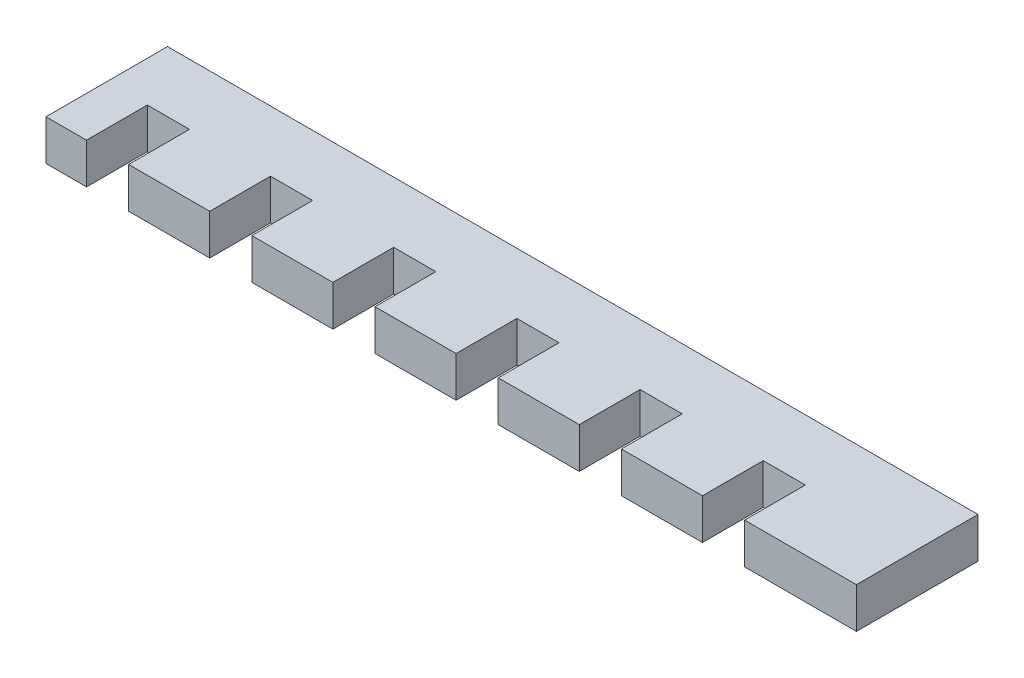
ISO-10303-21;
HEADER;
FILE_DESCRIPTION(('STEP AP214'),'2;1');
FILE_NAME('part.step','',(''),(''),'','','');
FILE_SCHEMA(('AUTOMOTIVE_DESIGN { 1 0 10303 214 1 1 1 1 }'));
ENDSEC;
DATA;
#1=APPLICATION_CONTEXT('core data for automotive mechanical design processes');
#2=APPLICATION_PROTOCOL_DEFINITION('international standard','automotive_design',2000,#1);
#3=PRODUCT_CONTEXT('',#1,'mechanical');
#4=PRODUCT('Part','Part','',(#3));
#5=PRODUCT_RELATED_PRODUCT_CATEGORY('part','',(#4));
#6=PRODUCT_DEFINITION_FORMATION('','',#4);
#7=PRODUCT_DEFINITION_CONTEXT('part definition',#1,'design');
#8=PRODUCT_DEFINITION('design','',#6,#7);
#9=PRODUCT_DEFINITION_SHAPE('','',#8);
#10=(LENGTH_UNIT() NAMED_UNIT(*) SI_UNIT(.MILLI.,.METRE.));
#11=(NAMED_UNIT(*) PLANE_ANGLE_UNIT() SI_UNIT($,.RADIAN.));
#12=(NAMED_UNIT(*) SI_UNIT($,.STERADIAN.) SOLID_ANGLE_UNIT());
#13=UNCERTAINTY_MEASURE_WITH_UNIT(LENGTH_MEASURE(1.E-05),#10,'distance_accuracy_value','');
#14=(GEOMETRIC_REPRESENTATION_CONTEXT(3) GLOBAL_UNCERTAINTY_ASSIGNED_CONTEXT((#13)) GLOBAL_UNIT_ASSIGNED_CONTEXT((#10,
#11,#12)) REPRESENTATION_CONTEXT('',''));
#15=CARTESIAN_POINT('',(0.,0.,0.));
#16=DIRECTION('',(0.,0.,1.));
#17=DIRECTION('',(1.,0.,0.));
#18=AXIS2_PLACEMENT_3D('',#15,#16,#17);
#19=CARTESIAN_POINT('',(-50.,5.,7.5));
#20=DIRECTION('',(0.,0.,-1.));
#21=DIRECTION('',(-1.,0.,0.));
#22=AXIS2_PLACEMENT_3D('',#19,#20,#21);
#23=PLANE('',#22);
#24=DIRECTION('',(0.,-1.,0.));
#25=VECTOR('',#24,1.);
#26=CARTESIAN_POINT('',(-29.8,5.,7.5));
#27=LINE('',#26,#25);
#28=CARTESIAN_POINT('',(-29.8,5.,7.5));
#29=VERTEX_POINT('',#28);
#30=CARTESIAN_POINT('',(-29.8,0.,7.5));
#31=VERTEX_POINT('',#30);
#32=EDGE_CURVE('E221',#29,#31,#27,.T.);
#33=ORIENTED_EDGE('',*,*,#32,.F.);
#34=DIRECTION('',(1.,0.,0.));
#35=VECTOR('',#34,1.);
#36=CARTESIAN_POINT('',(-50.,5.,7.5));
#37=LINE('',#36,#35);
#38=CARTESIAN_POINT('',(-39.8,5.,7.5));
#39=VERTEX_POINT('',#38);
#40=EDGE_CURVE('E233',#39,#29,#37,.T.);
#41=ORIENTED_EDGE('',*,*,#40,.F.);
#42=DIRECTION('',(0.,-1.,0.));
#43=VECTOR('',#42,1.);
#44=CARTESIAN_POINT('',(-39.8,5.,7.5));
#45=LINE('',#44,#43);
#46=CARTESIAN_POINT('',(-39.8,0.,7.5));
#47=VERTEX_POINT('',#46);
#48=EDGE_CURVE('E298',#39,#47,#45,.T.);
#49=ORIENTED_EDGE('',*,*,#48,.T.);
#50=DIRECTION('',(1.,0.,0.));
#51=VECTOR('',#50,1.);
#52=CARTESIAN_POINT('',(-50.,0.,7.5));
#53=LINE('',#52,#51);
#54=EDGE_CURVE('E235',#47,#31,#53,.T.);
#55=ORIENTED_EDGE('',*,*,#54,.T.);
#56=EDGE_LOOP('',(#33,#41,#49,#55));
#57=FACE_BOUND('',#56,.T.);
#58=ADVANCED_FACE('F33',(#57),#23,.F.);
#59=DIRECTION('',(0.,-1.,0.));
#60=VECTOR('',#59,1.);
#61=CARTESIAN_POINT('',(-24.6,5.,7.5));
#62=LINE('',#61,#60);
#63=CARTESIAN_POINT('',(-24.6,5.,7.5));
#64=VERTEX_POINT('',#63);
#65=CARTESIAN_POINT('',(-24.6,0.,7.5));
#66=VERTEX_POINT('',#65);
#67=EDGE_CURVE('E237',#64,#66,#62,.T.);
#68=ORIENTED_EDGE('',*,*,#67,.T.);
#69=CARTESIAN_POINT('',(-14.6,0.,7.5));
#70=VERTEX_POINT('',#69);
#71=EDGE_CURVE('E435',#66,#70,#53,.T.);
#72=ORIENTED_EDGE('',*,*,#71,.T.);
#73=DIRECTION('',(0.,-1.,0.));
#74=VECTOR('',#73,1.);
#75=CARTESIAN_POINT('',(-14.6,5.,7.5));
#76=LINE('',#75,#74);
#77=CARTESIAN_POINT('',(-14.6,5.,7.5));
#78=VERTEX_POINT('',#77);
#79=EDGE_CURVE('E390',#78,#70,#76,.T.);
#80=ORIENTED_EDGE('',*,*,#79,.F.);
#81=EDGE_CURVE('E244',#64,#78,#37,.T.);
#82=ORIENTED_EDGE('',*,*,#81,.F.);
#83=EDGE_LOOP('',(#68,#72,#80,#82));
#84=FACE_BOUND('',#83,.T.);
#85=ADVANCED_FACE('F437',(#84),#23,.F.);
#86=DIRECTION('',(0.,-1.,0.));
#87=VECTOR('',#86,1.);
#88=CARTESIAN_POINT('',(-9.4,5.,7.5));
#89=LINE('',#88,#87);
#90=CARTESIAN_POINT('',(-9.4,5.,7.5));
#91=VERTEX_POINT('',#90);
#92=CARTESIAN_POINT('',(-9.4,0.,7.5));
#93=VERTEX_POINT('',#92);
#94=EDGE_CURVE('E392',#91,#93,#89,.T.);
#95=ORIENTED_EDGE('',*,*,#94,.T.);
#96=CARTESIAN_POINT('',(0.599999999999996,0.,7.5));
#97=VERTEX_POINT('',#96);
#98=EDGE_CURVE('E449',#93,#97,#53,.T.);
#99=ORIENTED_EDGE('',*,*,#98,.T.);
#100=DIRECTION('',(0.,-1.,0.));
#101=VECTOR('',#100,1.);
#102=CARTESIAN_POINT('',(0.599999999999996,5.,7.5));
#103=LINE('',#102,#101);
#104=CARTESIAN_POINT('',(0.599999999999996,5.,7.5));
#105=VERTEX_POINT('',#104);
#106=EDGE_CURVE('E366',#105,#97,#103,.T.);
#107=ORIENTED_EDGE('',*,*,#106,.F.);
#108=EDGE_CURVE('E250',#91,#105,#37,.T.);
#109=ORIENTED_EDGE('',*,*,#108,.F.);
#110=EDGE_LOOP('',(#95,#99,#107,#109));
#111=FACE_BOUND('',#110,.T.);
#112=ADVANCED_FACE('F454',(#111),#23,.F.);
#113=DIRECTION('',(0.,-1.,0.));
#114=VECTOR('',#113,1.);
#115=CARTESIAN_POINT('',(5.8,5.,7.5));
#116=LINE('',#115,#114);
#117=CARTESIAN_POINT('',(5.8,5.,7.5));
#118=VERTEX_POINT('',#117);
#119=CARTESIAN_POINT('',(5.8,0.,7.5));
#120=VERTEX_POINT('',#119);
#121=EDGE_CURVE('E368',#118,#120,#116,.T.);
#122=ORIENTED_EDGE('',*,*,#121,.T.);
#123=CARTESIAN_POINT('',(15.8,0.,7.5));
#124=VERTEX_POINT('',#123);
#125=EDGE_CURVE('E527',#120,#124,#53,.T.);
#126=ORIENTED_EDGE('',*,*,#125,.T.);
#127=DIRECTION('',(0.,-1.,0.));
#128=VECTOR('',#127,1.);
#129=CARTESIAN_POINT('',(15.8,5.,7.5));
#130=LINE('',#129,#128);
#131=CARTESIAN_POINT('',(15.8,5.,7.5));
#132=VERTEX_POINT('',#131);
#133=EDGE_CURVE('E341',#132,#124,#130,.T.);
#134=ORIENTED_EDGE('',*,*,#133,.F.);
#135=EDGE_CURVE('E458',#118,#132,#37,.T.);
#136=ORIENTED_EDGE('',*,*,#135,.F.);
#137=EDGE_LOOP('',(#122,#126,#134,#136));
#138=FACE_BOUND('',#137,.T.);
#139=ADVANCED_FACE('F516',(#138),#23,.F.);
#140=DIRECTION('',(0.,-1.,0.));
#141=VECTOR('',#140,1.);
#142=CARTESIAN_POINT('',(21.,5.,7.5));
#143=LINE('',#142,#141);
#144=CARTESIAN_POINT('',(21.,5.,7.5));
#145=VERTEX_POINT('',#144);
#146=CARTESIAN_POINT('',(21.,0.,7.5));
#147=VERTEX_POINT('',#146);
#148=EDGE_CURVE('E344',#145,#147,#143,.T.);
#149=ORIENTED_EDGE('',*,*,#148,.T.);
#150=CARTESIAN_POINT('',(31.,0.,7.5));
#151=VERTEX_POINT('',#150);
#152=EDGE_CURVE('E474',#147,#151,#53,.T.);
#153=ORIENTED_EDGE('',*,*,#152,.T.);
#154=DIRECTION('',(0.,-1.,0.));
#155=VECTOR('',#154,1.);
#156=CARTESIAN_POINT('',(31.,5.,7.5));
#157=LINE('',#156,#155);
#158=CARTESIAN_POINT('',(31.,5.,7.5));
#159=VERTEX_POINT('',#158);
#160=EDGE_CURVE('E315',#159,#151,#157,.T.);
#161=ORIENTED_EDGE('',*,*,#160,.F.);
#162=EDGE_CURVE('E294',#145,#159,#37,.T.);
#163=ORIENTED_EDGE('',*,*,#162,.F.);
#164=EDGE_LOOP('',(#149,#153,#161,#163));
#165=FACE_BOUND('',#164,.T.);
#166=ADVANCED_FACE('F471',(#165),#23,.F.);
#167=DIRECTION('',(0.,-1.,0.));
#168=VECTOR('',#167,1.);
#169=CARTESIAN_POINT('',(36.2,5.,7.5));
#170=LINE('',#169,#168);
#171=CARTESIAN_POINT('',(36.2,5.,7.5));
#172=VERTEX_POINT('',#171);
#173=CARTESIAN_POINT('',(36.2,0.,7.5));
#174=VERTEX_POINT('',#173);
#175=EDGE_CURVE('E318',#172,#174,#170,.T.);
#176=ORIENTED_EDGE('',*,*,#175,.T.);
#177=CARTESIAN_POINT('',(50.,0.,7.5));
#178=VERTEX_POINT('',#177);
#179=EDGE_CURVE('E263',#174,#178,#53,.T.);
#180=ORIENTED_EDGE('',*,*,#179,.T.);
#181=DIRECTION('',(0.,-1.,0.));
#182=VECTOR('',#181,1.);
#183=CARTESIAN_POINT('',(50.,5.,7.5));
#184=LINE('',#183,#182);
#185=CARTESIAN_POINT('',(50.,5.,7.5));
#186=VERTEX_POINT('',#185);
#187=EDGE_CURVE('E247',#186,#178,#184,.T.);
#188=ORIENTED_EDGE('',*,*,#187,.F.);
#189=EDGE_CURVE('E248',#172,#186,#37,.T.);
#190=ORIENTED_EDGE('',*,*,#189,.F.);
#191=EDGE_LOOP('',(#176,#180,#188,#190));
#192=FACE_BOUND('',#191,.T.);
#193=ADVANCED_FACE('F488',(#192),#23,.F.);
#194=CARTESIAN_POINT('',(0.,5.,0.));
#195=DIRECTION('',(0.,1.,0.));
#196=DIRECTION('',(0.,0.,1.));
#197=AXIS2_PLACEMENT_3D('',#194,#195,#196);
#198=PLANE('',#197);
#199=ORIENTED_EDGE('',*,*,#40,.T.);
#200=DIRECTION('',(0.,0.,1.));
#201=VECTOR('',#200,1.);
#202=CARTESIAN_POINT('',(-29.8,5.,7.5));
#203=LINE('',#202,#201);
#204=CARTESIAN_POINT('',(-29.8,5.,0.));
#205=VERTEX_POINT('',#204);
#206=EDGE_CURVE('E218',#205,#29,#203,.T.);
#207=ORIENTED_EDGE('',*,*,#206,.F.);
#208=DIRECTION('',(-1.,0.,0.));
#209=VECTOR('',#208,1.);
#210=CARTESIAN_POINT('',(-29.8,5.,0.));
#211=LINE('',#210,#209);
#212=CARTESIAN_POINT('',(-24.6,5.,0.));
#213=VERTEX_POINT('',#212);
#214=EDGE_CURVE('E417',#213,#205,#211,.T.);
#215=ORIENTED_EDGE('',*,*,#214,.F.);
#216=DIRECTION('',(0.,0.,-1.));
#217=VECTOR('',#216,1.);
#218=CARTESIAN_POINT('',(-24.6,5.,7.5));
#219=LINE('',#218,#217);
#220=EDGE_CURVE('E226',#64,#213,#219,.T.);
#221=ORIENTED_EDGE('',*,*,#220,.F.);
#222=ORIENTED_EDGE('',*,*,#81,.T.);
#223=DIRECTION('',(0.,0.,1.));
#224=VECTOR('',#223,1.);
#225=CARTESIAN_POINT('',(-14.6,5.,7.5));
#226=LINE('',#225,#224);
#227=CARTESIAN_POINT('',(-14.6,5.,0.));
#228=VERTEX_POINT('',#227);
#229=EDGE_CURVE('E403',#228,#78,#226,.T.);
#230=ORIENTED_EDGE('',*,*,#229,.F.);
#231=DIRECTION('',(-1.,0.,0.));
#232=VECTOR('',#231,1.);
#233=CARTESIAN_POINT('',(-14.6,5.,0.));
#234=LINE('',#233,#232);
#235=CARTESIAN_POINT('',(-9.4,5.,0.));
#236=VERTEX_POINT('',#235);
#237=EDGE_CURVE('E399',#236,#228,#234,.T.);
#238=ORIENTED_EDGE('',*,*,#237,.F.);
#239=DIRECTION('',(0.,0.,-1.));
#240=VECTOR('',#239,1.);
#241=CARTESIAN_POINT('',(-9.4,5.,7.5));
#242=LINE('',#241,#240);
#243=EDGE_CURVE('E409',#91,#236,#242,.T.);
#244=ORIENTED_EDGE('',*,*,#243,.F.);
#245=ORIENTED_EDGE('',*,*,#108,.T.);
#246=DIRECTION('',(0.,0.,1.));
#247=VECTOR('',#246,1.);
#248=CARTESIAN_POINT('',(0.599999999999996,5.,7.5));
#249=LINE('',#248,#247);
#250=CARTESIAN_POINT('',(0.599999999999998,5.,0.));
#251=VERTEX_POINT('',#250);
#252=EDGE_CURVE('E380',#251,#105,#249,.T.);
#253=ORIENTED_EDGE('',*,*,#252,.F.);
#254=DIRECTION('',(-1.,0.,0.));
#255=VECTOR('',#254,1.);
#256=CARTESIAN_POINT('',(0.599999999999998,5.,0.));
#257=LINE('',#256,#255);
#258=CARTESIAN_POINT('',(5.8,5.,0.));
#259=VERTEX_POINT('',#258);
#260=EDGE_CURVE('E376',#259,#251,#257,.T.);
#261=ORIENTED_EDGE('',*,*,#260,.F.);
#262=DIRECTION('',(0.,0.,-1.));
#263=VECTOR('',#262,1.);
#264=CARTESIAN_POINT('',(5.8,5.,7.5));
#265=LINE('',#264,#263);
#266=EDGE_CURVE('E387',#118,#259,#265,.T.);
#267=ORIENTED_EDGE('',*,*,#266,.F.);
#268=ORIENTED_EDGE('',*,*,#135,.T.);
#269=DIRECTION('',(0.,0.,1.));
#270=VECTOR('',#269,1.);
#271=CARTESIAN_POINT('',(15.8,5.,7.5));
#272=LINE('',#271,#270);
#273=CARTESIAN_POINT('',(15.8,5.,0.));
#274=VERTEX_POINT('',#273);
#275=EDGE_CURVE('E356',#274,#132,#272,.T.);
#276=ORIENTED_EDGE('',*,*,#275,.F.);
#277=DIRECTION('',(-1.,0.,0.));
#278=VECTOR('',#277,1.);
#279=CARTESIAN_POINT('',(15.8,5.,0.));
#280=LINE('',#279,#278);
#281=CARTESIAN_POINT('',(21.,5.,0.));
#282=VERTEX_POINT('',#281);
#283=EDGE_CURVE('E352',#282,#274,#280,.T.);
#284=ORIENTED_EDGE('',*,*,#283,.F.);
#285=DIRECTION('',(0.,0.,-1.));
#286=VECTOR('',#285,1.);
#287=CARTESIAN_POINT('',(21.,5.,7.5));
#288=LINE('',#287,#286);
#289=EDGE_CURVE('E363',#145,#282,#288,.T.);
#290=ORIENTED_EDGE('',*,*,#289,.F.);
#291=ORIENTED_EDGE('',*,*,#162,.T.);
#292=DIRECTION('',(0.,0.,1.));
#293=VECTOR('',#292,1.);
#294=CARTESIAN_POINT('',(31.,5.,7.5));
#295=LINE('',#294,#293);
#296=CARTESIAN_POINT('',(31.,5.,0.));
#297=VERTEX_POINT('',#296);
#298=EDGE_CURVE('E330',#297,#159,#295,.T.);
#299=ORIENTED_EDGE('',*,*,#298,.F.);
#300=DIRECTION('',(-1.,0.,0.));
#301=VECTOR('',#300,1.);
#302=CARTESIAN_POINT('',(31.,5.,0.));
#303=LINE('',#302,#301);
#304=CARTESIAN_POINT('',(36.2,5.,0.));
#305=VERTEX_POINT('',#304);
#306=EDGE_CURVE('E326',#305,#297,#303,.T.);
#307=ORIENTED_EDGE('',*,*,#306,.F.);
#308=DIRECTION('',(0.,0.,-1.));
#309=VECTOR('',#308,1.);
#310=CARTESIAN_POINT('',(36.2,5.,7.5));
#311=LINE('',#310,#309);
#312=EDGE_CURVE('E338',#172,#305,#311,.T.);
#313=ORIENTED_EDGE('',*,*,#312,.F.);
#314=ORIENTED_EDGE('',*,*,#189,.T.);
#315=DIRECTION('',(0.,0.,-1.));
#316=VECTOR('',#315,1.);
#317=CARTESIAN_POINT('',(50.,5.,-7.5));
#318=LINE('',#317,#316);
#319=CARTESIAN_POINT('',(50.,5.,-7.5));
#320=VERTEX_POINT('',#319);
#321=EDGE_CURVE('E267',#186,#320,#318,.T.);
#322=ORIENTED_EDGE('',*,*,#321,.T.);
#323=DIRECTION('',(-1.,0.,0.));
#324=VECTOR('',#323,1.);
#325=CARTESIAN_POINT('',(-50.,5.,-7.5));
#326=LINE('',#325,#324);
#327=CARTESIAN_POINT('',(-50.,5.,-7.5));
#328=VERTEX_POINT('',#327);
#329=EDGE_CURVE('E293',#320,#328,#326,.T.);
#330=ORIENTED_EDGE('',*,*,#329,.T.);
#331=DIRECTION('',(0.,0.,1.));
#332=VECTOR('',#331,1.);
#333=CARTESIAN_POINT('',(-50.,5.,-7.5));
#334=LINE('',#333,#332);
#335=CARTESIAN_POINT('',(-50.,5.,7.5));
#336=VERTEX_POINT('',#335);
#337=EDGE_CURVE('E253',#328,#336,#334,.T.);
#338=ORIENTED_EDGE('',*,*,#337,.T.);
#339=CARTESIAN_POINT('',(-45.,5.,7.5));
#340=VERTEX_POINT('',#339);
#341=EDGE_CURVE('E243',#336,#340,#37,.T.);
#342=ORIENTED_EDGE('',*,*,#341,.T.);
#343=DIRECTION('',(0.,0.,1.));
#344=VECTOR('',#343,1.);
#345=CARTESIAN_POINT('',(-45.,5.,7.5));
#346=LINE('',#345,#344);
#347=CARTESIAN_POINT('',(-45.,5.,0.));
#348=VERTEX_POINT('',#347);
#349=EDGE_CURVE('E291',#348,#340,#346,.T.);
#350=ORIENTED_EDGE('',*,*,#349,.F.);
#351=DIRECTION('',(-1.,0.,0.));
#352=VECTOR('',#351,1.);
#353=CARTESIAN_POINT('',(-45.,5.,0.));
#354=LINE('',#353,#352);
#355=CARTESIAN_POINT('',(-39.8,5.,0.));
#356=VERTEX_POINT('',#355);
#357=EDGE_CURVE('E305',#356,#348,#354,.T.);
#358=ORIENTED_EDGE('',*,*,#357,.F.);
#359=DIRECTION('',(0.,0.,-1.));
#360=VECTOR('',#359,1.);
#361=CARTESIAN_POINT('',(-39.8,5.,7.5));
#362=LINE('',#361,#360);
#363=EDGE_CURVE('E242',#39,#356,#362,.T.);
#364=ORIENTED_EDGE('',*,*,#363,.F.);
#365=EDGE_LOOP('',(#199,#207,#215,#221,#222,#230,#238,#244,#245,#253,#261,#267,#268,#276,#284,
#290,#291,#299,#307,#313,#314,#322,#330,#338,#342,#350,#358,#364));
#366=FACE_BOUND('',#365,.T.);
#367=ADVANCED_FACE('F240',(#366),#198,.T.);
#368=CARTESIAN_POINT('',(0.,0.,0.));
#369=DIRECTION('',(0.,1.,0.));
#370=DIRECTION('',(0.,0.,1.));
#371=AXIS2_PLACEMENT_3D('',#368,#369,#370);
#372=PLANE('',#371);
#373=DIRECTION('',(0.,0.,1.));
#374=VECTOR('',#373,1.);
#375=CARTESIAN_POINT('',(-29.8,0.,7.5));
#376=LINE('',#375,#374);
#377=CARTESIAN_POINT('',(-29.8,0.,0.));
#378=VERTEX_POINT('',#377);
#379=EDGE_CURVE('E48',#378,#31,#376,.T.);
#380=ORIENTED_EDGE('',*,*,#379,.T.);
#381=ORIENTED_EDGE('',*,*,#54,.F.);
#382=DIRECTION('',(0.,0.,-1.));
#383=VECTOR('',#382,1.);
#384=CARTESIAN_POINT('',(-39.8,0.,7.5));
#385=LINE('',#384,#383);
#386=CARTESIAN_POINT('',(-39.8,0.,0.));
#387=VERTEX_POINT('',#386);
#388=EDGE_CURVE('E308',#47,#387,#385,.T.);
#389=ORIENTED_EDGE('',*,*,#388,.T.);
#390=DIRECTION('',(-1.,0.,0.));
#391=VECTOR('',#390,1.);
#392=CARTESIAN_POINT('',(-45.,0.,0.));
#393=LINE('',#392,#391);
#394=CARTESIAN_POINT('',(-45.,0.,0.));
#395=VERTEX_POINT('',#394);
#396=EDGE_CURVE('E306',#387,#395,#393,.T.);
#397=ORIENTED_EDGE('',*,*,#396,.T.);
#398=DIRECTION('',(0.,0.,1.));
#399=VECTOR('',#398,1.);
#400=CARTESIAN_POINT('',(-45.,0.,7.5));
#401=LINE('',#400,#399);
#402=CARTESIAN_POINT('',(-45.,0.,7.5));
#403=VERTEX_POINT('',#402);
#404=EDGE_CURVE('E236',#395,#403,#401,.T.);
#405=ORIENTED_EDGE('',*,*,#404,.T.);
#406=CARTESIAN_POINT('',(-50.,0.,7.5));
#407=VERTEX_POINT('',#406);
#408=EDGE_CURVE('E264',#407,#403,#53,.T.);
#409=ORIENTED_EDGE('',*,*,#408,.F.);
#410=DIRECTION('',(0.,0.,1.));
#411=VECTOR('',#410,1.);
#412=CARTESIAN_POINT('',(-50.,0.,-7.5));
#413=LINE('',#412,#411);
#414=CARTESIAN_POINT('',(-50.,0.,-7.5));
#415=VERTEX_POINT('',#414);
#416=EDGE_CURVE('E261',#415,#407,#413,.T.);
#417=ORIENTED_EDGE('',*,*,#416,.F.);
#418=DIRECTION('',(-1.,0.,0.));
#419=VECTOR('',#418,1.);
#420=CARTESIAN_POINT('',(-50.,0.,-7.5));
#421=LINE('',#420,#419);
#422=CARTESIAN_POINT('',(50.,0.,-7.5));
#423=VERTEX_POINT('',#422);
#424=EDGE_CURVE('E258',#423,#415,#421,.T.);
#425=ORIENTED_EDGE('',*,*,#424,.F.);
#426=DIRECTION('',(0.,0.,-1.));
#427=VECTOR('',#426,1.);
#428=CARTESIAN_POINT('',(50.,0.,-7.5));
#429=LINE('',#428,#427);
#430=EDGE_CURVE('E255',#178,#423,#429,.T.);
#431=ORIENTED_EDGE('',*,*,#430,.F.);
#432=ORIENTED_EDGE('',*,*,#179,.F.);
#433=DIRECTION('',(0.,0.,-1.));
#434=VECTOR('',#433,1.);
#435=CARTESIAN_POINT('',(36.2,0.,7.5));
#436=LINE('',#435,#434);
#437=CARTESIAN_POINT('',(36.2,0.,0.));
#438=VERTEX_POINT('',#437);
#439=EDGE_CURVE('E331',#174,#438,#436,.T.);
#440=ORIENTED_EDGE('',*,*,#439,.T.);
#441=DIRECTION('',(-1.,0.,0.));
#442=VECTOR('',#441,1.);
#443=CARTESIAN_POINT('',(31.,0.,0.));
#444=LINE('',#443,#442);
#445=CARTESIAN_POINT('',(31.,0.,0.));
#446=VERTEX_POINT('',#445);
#447=EDGE_CURVE('E327',#438,#446,#444,.T.);
#448=ORIENTED_EDGE('',*,*,#447,.T.);
#449=DIRECTION('',(0.,0.,1.));
#450=VECTOR('',#449,1.);
#451=CARTESIAN_POINT('',(31.,0.,7.5));
#452=LINE('',#451,#450);
#453=EDGE_CURVE('E334',#446,#151,#452,.T.);
#454=ORIENTED_EDGE('',*,*,#453,.T.);
#455=ORIENTED_EDGE('',*,*,#152,.F.);
#456=DIRECTION('',(0.,0.,-1.));
#457=VECTOR('',#456,1.);
#458=CARTESIAN_POINT('',(21.,0.,7.5));
#459=LINE('',#458,#457);
#460=CARTESIAN_POINT('',(21.,0.,0.));
#461=VERTEX_POINT('',#460);
#462=EDGE_CURVE('E357',#147,#461,#459,.T.);
#463=ORIENTED_EDGE('',*,*,#462,.T.);
#464=DIRECTION('',(-1.,0.,0.));
#465=VECTOR('',#464,1.);
#466=CARTESIAN_POINT('',(15.8,0.,0.));
#467=LINE('',#466,#465);
#468=CARTESIAN_POINT('',(15.8,0.,0.));
#469=VERTEX_POINT('',#468);
#470=EDGE_CURVE('E353',#461,#469,#467,.T.);
#471=ORIENTED_EDGE('',*,*,#470,.T.);
#472=DIRECTION('',(0.,0.,1.));
#473=VECTOR('',#472,1.);
#474=CARTESIAN_POINT('',(15.8,0.,7.5));
#475=LINE('',#474,#473);
#476=EDGE_CURVE('E317',#469,#124,#475,.T.);
#477=ORIENTED_EDGE('',*,*,#476,.T.);
#478=ORIENTED_EDGE('',*,*,#125,.F.);
#479=DIRECTION('',(0.,0.,-1.));
#480=VECTOR('',#479,1.);
#481=CARTESIAN_POINT('',(5.8,0.,7.5));
#482=LINE('',#481,#480);
#483=CARTESIAN_POINT('',(5.8,0.,0.));
#484=VERTEX_POINT('',#483);
#485=EDGE_CURVE('E381',#120,#484,#482,.T.);
#486=ORIENTED_EDGE('',*,*,#485,.T.);
#487=DIRECTION('',(-1.,0.,0.));
#488=VECTOR('',#487,1.);
#489=CARTESIAN_POINT('',(0.599999999999998,0.,0.));
#490=LINE('',#489,#488);
#491=CARTESIAN_POINT('',(0.599999999999998,0.,0.));
#492=VERTEX_POINT('',#491);
#493=EDGE_CURVE('E377',#484,#492,#490,.T.);
#494=ORIENTED_EDGE('',*,*,#493,.T.);
#495=DIRECTION('',(0.,0.,1.));
#496=VECTOR('',#495,1.);
#497=CARTESIAN_POINT('',(0.599999999999996,0.,7.5));
#498=LINE('',#497,#496);
#499=EDGE_CURVE('E343',#492,#97,#498,.T.);
#500=ORIENTED_EDGE('',*,*,#499,.T.);
#501=ORIENTED_EDGE('',*,*,#98,.F.);
#502=DIRECTION('',(0.,0.,-1.));
#503=VECTOR('',#502,1.);
#504=CARTESIAN_POINT('',(-9.4,0.,7.5));
#505=LINE('',#504,#503);
#506=CARTESIAN_POINT('',(-9.4,0.,0.));
#507=VERTEX_POINT('',#506);
#508=EDGE_CURVE('E404',#93,#507,#505,.T.);
#509=ORIENTED_EDGE('',*,*,#508,.T.);
#510=DIRECTION('',(-1.,0.,0.));
#511=VECTOR('',#510,1.);
#512=CARTESIAN_POINT('',(-14.6,0.,0.));
#513=LINE('',#512,#511);
#514=CARTESIAN_POINT('',(-14.6,0.,0.));
#515=VERTEX_POINT('',#514);
#516=EDGE_CURVE('E400',#507,#515,#513,.T.);
#517=ORIENTED_EDGE('',*,*,#516,.T.);
#518=DIRECTION('',(0.,0.,1.));
#519=VECTOR('',#518,1.);
#520=CARTESIAN_POINT('',(-14.6,0.,7.5));
#521=LINE('',#520,#519);
#522=EDGE_CURVE('E56',#515,#70,#521,.T.);
#523=ORIENTED_EDGE('',*,*,#522,.T.);
#524=ORIENTED_EDGE('',*,*,#71,.F.);
#525=DIRECTION('',(0.,0.,-1.));
#526=VECTOR('',#525,1.);
#527=CARTESIAN_POINT('',(-24.6,0.,7.5));
#528=LINE('',#527,#526);
#529=CARTESIAN_POINT('',(-24.6,0.,0.));
#530=VERTEX_POINT('',#529);
#531=EDGE_CURVE('E420',#66,#530,#528,.T.);
#532=ORIENTED_EDGE('',*,*,#531,.T.);
#533=DIRECTION('',(-1.,0.,0.));
#534=VECTOR('',#533,1.);
#535=CARTESIAN_POINT('',(-29.8,0.,0.));
#536=LINE('',#535,#534);
#537=EDGE_CURVE('E227',#530,#378,#536,.T.);
#538=ORIENTED_EDGE('',*,*,#537,.T.);
#539=EDGE_LOOP('',(#380,#381,#389,#397,#405,#409,#417,#425,#431,#432,#440,#448,#454,#455,#463,
#471,#477,#478,#486,#494,#500,#501,#509,#517,#523,#524,#532,#538));
#540=FACE_BOUND('',#539,.T.);
#541=ADVANCED_FACE('F282',(#540),#372,.F.);
#542=DIRECTION('',(0.,-1.,0.));
#543=VECTOR('',#542,1.);
#544=CARTESIAN_POINT('',(-45.,5.,7.5));
#545=LINE('',#544,#543);
#546=EDGE_CURVE('E259',#340,#403,#545,.T.);
#547=ORIENTED_EDGE('',*,*,#546,.F.);
#548=ORIENTED_EDGE('',*,*,#341,.F.);
#549=DIRECTION('',(0.,-1.,0.));
#550=VECTOR('',#549,1.);
#551=CARTESIAN_POINT('',(-50.,5.,7.5));
#552=LINE('',#551,#550);
#553=EDGE_CURVE('E270',#336,#407,#552,.T.);
#554=ORIENTED_EDGE('',*,*,#553,.T.);
#555=ORIENTED_EDGE('',*,*,#408,.T.);
#556=EDGE_LOOP('',(#547,#548,#554,#555));
#557=FACE_BOUND('',#556,.T.);
#558=ADVANCED_FACE('F288',(#557),#23,.F.);
#559=CARTESIAN_POINT('',(50.,5.,-7.5));
#560=DIRECTION('',(-1.,0.,0.));
#561=DIRECTION('',(0.,0.,1.));
#562=AXIS2_PLACEMENT_3D('',#559,#560,#561);
#563=PLANE('',#562);
#564=ORIENTED_EDGE('',*,*,#430,.T.);
#565=DIRECTION('',(0.,-1.,0.));
#566=VECTOR('',#565,1.);
#567=CARTESIAN_POINT('',(50.,5.,-7.5));
#568=LINE('',#567,#566);
#569=EDGE_CURVE('E11',#320,#423,#568,.T.);
#570=ORIENTED_EDGE('',*,*,#569,.F.);
#571=ORIENTED_EDGE('',*,*,#321,.F.);
#572=ORIENTED_EDGE('',*,*,#187,.T.);
#573=EDGE_LOOP('',(#564,#570,#571,#572));
#574=FACE_BOUND('',#573,.T.);
#575=ADVANCED_FACE('F35',(#574),#563,.F.);
#576=CARTESIAN_POINT('',(-50.,5.,-7.5));
#577=DIRECTION('',(0.,0.,1.));
#578=DIRECTION('',(1.,0.,0.));
#579=AXIS2_PLACEMENT_3D('',#576,#577,#578);
#580=PLANE('',#579);
#581=ORIENTED_EDGE('',*,*,#424,.T.);
#582=DIRECTION('',(0.,-1.,0.));
#583=VECTOR('',#582,1.);
#584=CARTESIAN_POINT('',(-50.,5.,-7.5));
#585=LINE('',#584,#583);
#586=EDGE_CURVE('E41',#328,#415,#585,.T.);
#587=ORIENTED_EDGE('',*,*,#586,.F.);
#588=ORIENTED_EDGE('',*,*,#329,.F.);
#589=ORIENTED_EDGE('',*,*,#569,.T.);
#590=EDGE_LOOP('',(#581,#587,#588,#589));
#591=FACE_BOUND('',#590,.T.);
#592=ADVANCED_FACE('F492',(#591),#580,.F.);
#593=CARTESIAN_POINT('',(-50.,5.,-7.5));
#594=DIRECTION('',(1.,0.,0.));
#595=DIRECTION('',(0.,0.,-1.));
#596=AXIS2_PLACEMENT_3D('',#593,#594,#595);
#597=PLANE('',#596);
#598=ORIENTED_EDGE('',*,*,#416,.T.);
#599=ORIENTED_EDGE('',*,*,#553,.F.);
#600=ORIENTED_EDGE('',*,*,#337,.F.);
#601=ORIENTED_EDGE('',*,*,#586,.T.);
#602=EDGE_LOOP('',(#598,#599,#600,#601));
#603=FACE_BOUND('',#602,.T.);
#604=ADVANCED_FACE('F277',(#603),#597,.F.);
#605=CARTESIAN_POINT('',(-45.,5.,7.5));
#606=DIRECTION('',(1.,0.,0.));
#607=DIRECTION('',(0.,0.,-1.));
#608=AXIS2_PLACEMENT_3D('',#605,#606,#607);
#609=PLANE('',#608);
#610=ORIENTED_EDGE('',*,*,#404,.F.);
#611=DIRECTION('',(0.,-1.,0.));
#612=VECTOR('',#611,1.);
#613=CARTESIAN_POINT('',(-45.,5.,0.));
#614=LINE('',#613,#612);
#615=EDGE_CURVE('E302',#348,#395,#614,.T.);
#616=ORIENTED_EDGE('',*,*,#615,.F.);
#617=ORIENTED_EDGE('',*,*,#349,.T.);
#618=ORIENTED_EDGE('',*,*,#546,.T.);
#619=EDGE_LOOP('',(#610,#616,#617,#618));
#620=FACE_BOUND('',#619,.T.);
#621=ADVANCED_FACE('F498',(#620),#609,.T.);
#622=CARTESIAN_POINT('',(-39.8,5.,7.5));
#623=DIRECTION('',(-1.,0.,0.));
#624=DIRECTION('',(0.,0.,1.));
#625=AXIS2_PLACEMENT_3D('',#622,#623,#624);
#626=PLANE('',#625);
#627=ORIENTED_EDGE('',*,*,#388,.F.);
#628=ORIENTED_EDGE('',*,*,#48,.F.);
#629=ORIENTED_EDGE('',*,*,#363,.T.);
#630=DIRECTION('',(0.,-1.,0.));
#631=VECTOR('',#630,1.);
#632=CARTESIAN_POINT('',(-39.8,5.,0.));
#633=LINE('',#632,#631);
#634=EDGE_CURVE('E300',#356,#387,#633,.T.);
#635=ORIENTED_EDGE('',*,*,#634,.T.);
#636=EDGE_LOOP('',(#627,#628,#629,#635));
#637=FACE_BOUND('',#636,.T.);
#638=ADVANCED_FACE('F559',(#637),#626,.T.);
#639=CARTESIAN_POINT('',(-45.,5.,0.));
#640=DIRECTION('',(0.,0.,1.));
#641=DIRECTION('',(1.,0.,0.));
#642=AXIS2_PLACEMENT_3D('',#639,#640,#641);
#643=PLANE('',#642);
#644=ORIENTED_EDGE('',*,*,#396,.F.);
#645=ORIENTED_EDGE('',*,*,#634,.F.);
#646=ORIENTED_EDGE('',*,*,#357,.T.);
#647=ORIENTED_EDGE('',*,*,#615,.T.);
#648=EDGE_LOOP('',(#644,#645,#646,#647));
#649=FACE_BOUND('',#648,.T.);
#650=ADVANCED_FACE('F556',(#649),#643,.T.);
#651=CARTESIAN_POINT('',(31.,5.,7.5));
#652=DIRECTION('',(1.,0.,0.));
#653=DIRECTION('',(0.,0.,-1.));
#654=AXIS2_PLACEMENT_3D('',#651,#652,#653);
#655=PLANE('',#654);
#656=ORIENTED_EDGE('',*,*,#453,.F.);
#657=DIRECTION('',(0.,-1.,0.));
#658=VECTOR('',#657,1.);
#659=CARTESIAN_POINT('',(31.,5.,0.));
#660=LINE('',#659,#658);
#661=EDGE_CURVE('E323',#297,#446,#660,.T.);
#662=ORIENTED_EDGE('',*,*,#661,.F.);
#663=ORIENTED_EDGE('',*,*,#298,.T.);
#664=ORIENTED_EDGE('',*,*,#160,.T.);
#665=EDGE_LOOP('',(#656,#662,#663,#664));
#666=FACE_BOUND('',#665,.T.);
#667=ADVANCED_FACE('F476',(#666),#655,.T.);
#668=CARTESIAN_POINT('',(36.2,5.,7.5));
#669=DIRECTION('',(-1.,0.,0.));
#670=DIRECTION('',(0.,0.,1.));
#671=AXIS2_PLACEMENT_3D('',#668,#669,#670);
#672=PLANE('',#671);
#673=ORIENTED_EDGE('',*,*,#439,.F.);
#674=ORIENTED_EDGE('',*,*,#175,.F.);
#675=ORIENTED_EDGE('',*,*,#312,.T.);
#676=DIRECTION('',(0.,-1.,0.));
#677=VECTOR('',#676,1.);
#678=CARTESIAN_POINT('',(36.2,5.,0.));
#679=LINE('',#678,#677);
#680=EDGE_CURVE('E321',#305,#438,#679,.T.);
#681=ORIENTED_EDGE('',*,*,#680,.T.);
#682=EDGE_LOOP('',(#673,#674,#675,#681));
#683=FACE_BOUND('',#682,.T.);
#684=ADVANCED_FACE('F551',(#683),#672,.T.);
#685=CARTESIAN_POINT('',(31.,5.,0.));
#686=DIRECTION('',(0.,0.,1.));
#687=DIRECTION('',(1.,0.,0.));
#688=AXIS2_PLACEMENT_3D('',#685,#686,#687);
#689=PLANE('',#688);
#690=ORIENTED_EDGE('',*,*,#447,.F.);
#691=ORIENTED_EDGE('',*,*,#680,.F.);
#692=ORIENTED_EDGE('',*,*,#306,.T.);
#693=ORIENTED_EDGE('',*,*,#661,.T.);
#694=EDGE_LOOP('',(#690,#691,#692,#693));
#695=FACE_BOUND('',#694,.T.);
#696=ADVANCED_FACE('F482',(#695),#689,.T.);
#697=CARTESIAN_POINT('',(15.8,5.,7.5));
#698=DIRECTION('',(1.,0.,0.));
#699=DIRECTION('',(0.,0.,-1.));
#700=AXIS2_PLACEMENT_3D('',#697,#698,#699);
#701=PLANE('',#700);
#702=ORIENTED_EDGE('',*,*,#476,.F.);
#703=DIRECTION('',(0.,-1.,0.));
#704=VECTOR('',#703,1.);
#705=CARTESIAN_POINT('',(15.8,5.,0.));
#706=LINE('',#705,#704);
#707=EDGE_CURVE('E349',#274,#469,#706,.T.);
#708=ORIENTED_EDGE('',*,*,#707,.F.);
#709=ORIENTED_EDGE('',*,*,#275,.T.);
#710=ORIENTED_EDGE('',*,*,#133,.T.);
#711=EDGE_LOOP('',(#702,#708,#709,#710));
#712=FACE_BOUND('',#711,.T.);
#713=ADVANCED_FACE('F532',(#712),#701,.T.);
#714=CARTESIAN_POINT('',(21.,5.,7.5));
#715=DIRECTION('',(-1.,0.,0.));
#716=DIRECTION('',(0.,0.,1.));
#717=AXIS2_PLACEMENT_3D('',#714,#715,#716);
#718=PLANE('',#717);
#719=ORIENTED_EDGE('',*,*,#462,.F.);
#720=ORIENTED_EDGE('',*,*,#148,.F.);
#721=ORIENTED_EDGE('',*,*,#289,.T.);
#722=DIRECTION('',(0.,-1.,0.));
#723=VECTOR('',#722,1.);
#724=CARTESIAN_POINT('',(21.,5.,0.));
#725=LINE('',#724,#723);
#726=EDGE_CURVE('E347',#282,#461,#725,.T.);
#727=ORIENTED_EDGE('',*,*,#726,.T.);
#728=EDGE_LOOP('',(#719,#720,#721,#727));
#729=FACE_BOUND('',#728,.T.);
#730=ADVANCED_FACE('F537',(#729),#718,.T.);
#731=CARTESIAN_POINT('',(15.8,5.,0.));
#732=DIRECTION('',(0.,0.,1.));
#733=DIRECTION('',(1.,0.,0.));
#734=AXIS2_PLACEMENT_3D('',#731,#732,#733);
#735=PLANE('',#734);
#736=ORIENTED_EDGE('',*,*,#470,.F.);
#737=ORIENTED_EDGE('',*,*,#726,.F.);
#738=ORIENTED_EDGE('',*,*,#283,.T.);
#739=ORIENTED_EDGE('',*,*,#707,.T.);
#740=EDGE_LOOP('',(#736,#737,#738,#739));
#741=FACE_BOUND('',#740,.T.);
#742=ADVANCED_FACE('F534',(#741),#735,.T.);
#743=CARTESIAN_POINT('',(0.599999999999996,5.,7.5));
#744=DIRECTION('',(1.,0.,0.));
#745=DIRECTION('',(0.,0.,-1.));
#746=AXIS2_PLACEMENT_3D('',#743,#744,#745);
#747=PLANE('',#746);
#748=ORIENTED_EDGE('',*,*,#499,.F.);
#749=DIRECTION('',(0.,-1.,0.));
#750=VECTOR('',#749,1.);
#751=CARTESIAN_POINT('',(0.599999999999998,5.,0.));
#752=LINE('',#751,#750);
#753=EDGE_CURVE('E373',#251,#492,#752,.T.);
#754=ORIENTED_EDGE('',*,*,#753,.F.);
#755=ORIENTED_EDGE('',*,*,#252,.T.);
#756=ORIENTED_EDGE('',*,*,#106,.T.);
#757=EDGE_LOOP('',(#748,#754,#755,#756));
#758=FACE_BOUND('',#757,.T.);
#759=ADVANCED_FACE('F544',(#758),#747,.T.);
#760=CARTESIAN_POINT('',(5.8,5.,7.5));
#761=DIRECTION('',(-1.,0.,0.));
#762=DIRECTION('',(0.,0.,1.));
#763=AXIS2_PLACEMENT_3D('',#760,#761,#762);
#764=PLANE('',#763);
#765=ORIENTED_EDGE('',*,*,#485,.F.);
#766=ORIENTED_EDGE('',*,*,#121,.F.);
#767=ORIENTED_EDGE('',*,*,#266,.T.);
#768=DIRECTION('',(0.,-1.,0.));
#769=VECTOR('',#768,1.);
#770=CARTESIAN_POINT('',(5.8,5.,0.));
#771=LINE('',#770,#769);
#772=EDGE_CURVE('E371',#259,#484,#771,.T.);
#773=ORIENTED_EDGE('',*,*,#772,.T.);
#774=EDGE_LOOP('',(#765,#766,#767,#773));
#775=FACE_BOUND('',#774,.T.);
#776=ADVANCED_FACE('F616',(#775),#764,.T.);
#777=CARTESIAN_POINT('',(0.599999999999998,5.,0.));
#778=DIRECTION('',(0.,0.,1.));
#779=DIRECTION('',(1.,0.,0.));
#780=AXIS2_PLACEMENT_3D('',#777,#778,#779);
#781=PLANE('',#780);
#782=ORIENTED_EDGE('',*,*,#493,.F.);
#783=ORIENTED_EDGE('',*,*,#772,.F.);
#784=ORIENTED_EDGE('',*,*,#260,.T.);
#785=ORIENTED_EDGE('',*,*,#753,.T.);
#786=EDGE_LOOP('',(#782,#783,#784,#785));
#787=FACE_BOUND('',#786,.T.);
#788=ADVANCED_FACE('F625',(#787),#781,.T.);
#789=CARTESIAN_POINT('',(-14.6,5.,7.5));
#790=DIRECTION('',(1.,0.,0.));
#791=DIRECTION('',(0.,0.,-1.));
#792=AXIS2_PLACEMENT_3D('',#789,#790,#791);
#793=PLANE('',#792);
#794=ORIENTED_EDGE('',*,*,#522,.F.);
#795=DIRECTION('',(0.,-1.,0.));
#796=VECTOR('',#795,1.);
#797=CARTESIAN_POINT('',(-14.6,5.,0.));
#798=LINE('',#797,#796);
#799=EDGE_CURVE('E397',#228,#515,#798,.T.);
#800=ORIENTED_EDGE('',*,*,#799,.F.);
#801=ORIENTED_EDGE('',*,*,#229,.T.);
#802=ORIENTED_EDGE('',*,*,#79,.T.);
#803=EDGE_LOOP('',(#794,#800,#801,#802));
#804=FACE_BOUND('',#803,.T.);
#805=ADVANCED_FACE('F442',(#804),#793,.T.);
#806=CARTESIAN_POINT('',(-9.4,5.,7.5));
#807=DIRECTION('',(-1.,0.,0.));
#808=DIRECTION('',(0.,0.,1.));
#809=AXIS2_PLACEMENT_3D('',#806,#807,#808);
#810=PLANE('',#809);
#811=ORIENTED_EDGE('',*,*,#508,.F.);
#812=ORIENTED_EDGE('',*,*,#94,.F.);
#813=ORIENTED_EDGE('',*,*,#243,.T.);
#814=DIRECTION('',(0.,-1.,0.));
#815=VECTOR('',#814,1.);
#816=CARTESIAN_POINT('',(-9.4,5.,0.));
#817=LINE('',#816,#815);
#818=EDGE_CURVE('E395',#236,#507,#817,.T.);
#819=ORIENTED_EDGE('',*,*,#818,.T.);
#820=EDGE_LOOP('',(#811,#812,#813,#819));
#821=FACE_BOUND('',#820,.T.);
#822=ADVANCED_FACE('F451',(#821),#810,.T.);
#823=CARTESIAN_POINT('',(-14.6,5.,0.));
#824=DIRECTION('',(0.,0.,1.));
#825=DIRECTION('',(1.,0.,0.));
#826=AXIS2_PLACEMENT_3D('',#823,#824,#825);
#827=PLANE('',#826);
#828=ORIENTED_EDGE('',*,*,#516,.F.);
#829=ORIENTED_EDGE('',*,*,#818,.F.);
#830=ORIENTED_EDGE('',*,*,#237,.T.);
#831=ORIENTED_EDGE('',*,*,#799,.T.);
#832=EDGE_LOOP('',(#828,#829,#830,#831));
#833=FACE_BOUND('',#832,.T.);
#834=ADVANCED_FACE('F445',(#833),#827,.T.);
#835=CARTESIAN_POINT('',(-29.8,5.,7.5));
#836=DIRECTION('',(1.,0.,0.));
#837=DIRECTION('',(0.,0.,-1.));
#838=AXIS2_PLACEMENT_3D('',#835,#836,#837);
#839=PLANE('',#838);
#840=ORIENTED_EDGE('',*,*,#379,.F.);
#841=DIRECTION('',(0.,-1.,0.));
#842=VECTOR('',#841,1.);
#843=CARTESIAN_POINT('',(-29.8,5.,0.));
#844=LINE('',#843,#842);
#845=EDGE_CURVE('E222',#205,#378,#844,.T.);
#846=ORIENTED_EDGE('',*,*,#845,.F.);
#847=ORIENTED_EDGE('',*,*,#206,.T.);
#848=ORIENTED_EDGE('',*,*,#32,.T.);
#849=EDGE_LOOP('',(#840,#846,#847,#848));
#850=FACE_BOUND('',#849,.T.);
#851=ADVANCED_FACE('F220',(#850),#839,.T.);
#852=CARTESIAN_POINT('',(-24.6,5.,7.5));
#853=DIRECTION('',(-1.,0.,0.));
#854=DIRECTION('',(0.,0.,1.));
#855=AXIS2_PLACEMENT_3D('',#852,#853,#854);
#856=PLANE('',#855);
#857=ORIENTED_EDGE('',*,*,#531,.F.);
#858=ORIENTED_EDGE('',*,*,#67,.F.);
#859=ORIENTED_EDGE('',*,*,#220,.T.);
#860=DIRECTION('',(0.,-1.,0.));
#861=VECTOR('',#860,1.);
#862=CARTESIAN_POINT('',(-24.6,5.,0.));
#863=LINE('',#862,#861);
#864=EDGE_CURVE('E414',#213,#530,#863,.T.);
#865=ORIENTED_EDGE('',*,*,#864,.T.);
#866=EDGE_LOOP('',(#857,#858,#859,#865));
#867=FACE_BOUND('',#866,.T.);
#868=ADVANCED_FACE('F428',(#867),#856,.T.);
#869=CARTESIAN_POINT('',(-29.8,5.,0.));
#870=DIRECTION('',(0.,0.,1.));
#871=DIRECTION('',(1.,0.,0.));
#872=AXIS2_PLACEMENT_3D('',#869,#870,#871);
#873=PLANE('',#872);
#874=ORIENTED_EDGE('',*,*,#537,.F.);
#875=ORIENTED_EDGE('',*,*,#864,.F.);
#876=ORIENTED_EDGE('',*,*,#214,.T.);
#877=ORIENTED_EDGE('',*,*,#845,.T.);
#878=EDGE_LOOP('',(#874,#875,#876,#877));
#879=FACE_BOUND('',#878,.T.);
#880=ADVANCED_FACE('F432',(#879),#873,.T.);
#881=CLOSED_SHELL('',(#58,#85,#112,#139,#166,#193,#367,#541,#558,#575,#592,#604,#621,#638,#650,
#667,#684,#696,#713,#730,#742,#759,#776,#788,#805,#822,#834,#851,#868,#880));
#882=MANIFOLD_SOLID_BREP('B2',#881);
#883=ADVANCED_BREP_SHAPE_REPRESENTATION('',(#18,#882),#14);
#884=SHAPE_DEFINITION_REPRESENTATION(#9,#883);
ENDSEC;
END-ISO-10303-21;
